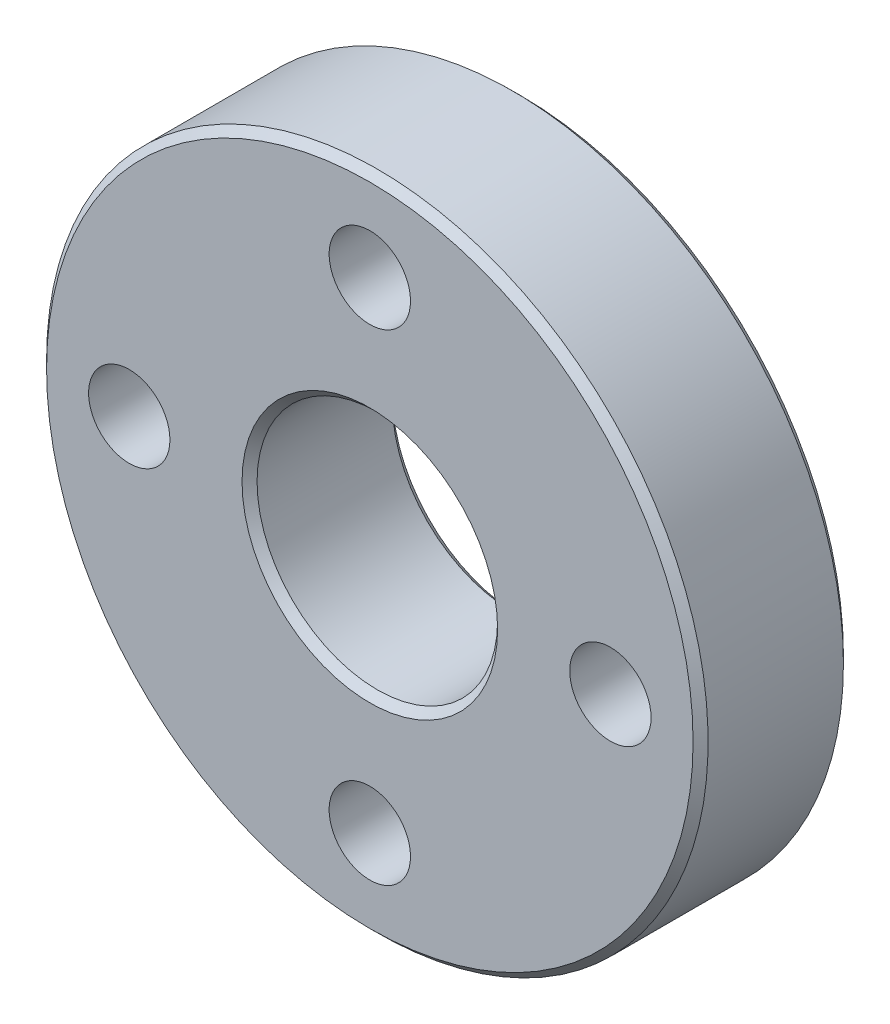
ISO-10303-21;
HEADER;
FILE_DESCRIPTION(('STEP AP214'),'2;1');
FILE_NAME('part.step','',(''),(''),'','','');
FILE_SCHEMA(('AUTOMOTIVE_DESIGN { 1 0 10303 214 1 1 1 1 }'));
ENDSEC;
DATA;
#1=APPLICATION_CONTEXT('core data for automotive mechanical design processes');
#2=APPLICATION_PROTOCOL_DEFINITION('international standard','automotive_design',2000,#1);
#3=PRODUCT_CONTEXT('',#1,'mechanical');
#4=PRODUCT('Part','Part','',(#3));
#5=PRODUCT_RELATED_PRODUCT_CATEGORY('part','',(#4));
#6=PRODUCT_DEFINITION_FORMATION('','',#4);
#7=PRODUCT_DEFINITION_CONTEXT('part definition',#1,'design');
#8=PRODUCT_DEFINITION('design','',#6,#7);
#9=PRODUCT_DEFINITION_SHAPE('','',#8);
#10=(LENGTH_UNIT() NAMED_UNIT(*) SI_UNIT(.MILLI.,.METRE.));
#11=(NAMED_UNIT(*) PLANE_ANGLE_UNIT() SI_UNIT($,.RADIAN.));
#12=(NAMED_UNIT(*) SI_UNIT($,.STERADIAN.) SOLID_ANGLE_UNIT());
#13=UNCERTAINTY_MEASURE_WITH_UNIT(LENGTH_MEASURE(1.E-05),#10,'distance_accuracy_value','');
#14=(GEOMETRIC_REPRESENTATION_CONTEXT(3) GLOBAL_UNCERTAINTY_ASSIGNED_CONTEXT((#13)) GLOBAL_UNIT_ASSIGNED_CONTEXT((#10,
#11,#12)) REPRESENTATION_CONTEXT('',''));
#15=CARTESIAN_POINT('',(0.,0.,0.));
#16=DIRECTION('',(0.,0.,1.));
#17=DIRECTION('',(1.,0.,0.));
#18=AXIS2_PLACEMENT_3D('',#15,#16,#17);
#19=CARTESIAN_POINT('',(0.,0.,-2.24999999994679));
#20=DIRECTION('',(0.,0.,1.));
#21=DIRECTION('',(1.,0.,0.));
#22=AXIS2_PLACEMENT_3D('',#19,#20,#21);
#23=CONICAL_SURFACE('',#22,11.0000000000241,0.785398163511135);
#24=CARTESIAN_POINT('',(0.,0.,-2.25));
#25=DIRECTION('',(0.,0.,-1.));
#26=DIRECTION('',(-1.,0.,0.));
#27=AXIS2_PLACEMENT_3D('',#24,#25,#26);
#28=CIRCLE('',#27,11.);
#29=CARTESIAN_POINT('',(-11.,0.,-2.25));
#30=VERTEX_POINT('',#29);
#31=EDGE_CURVE('E28',#30,#30,#28,.F.);
#32=ORIENTED_EDGE('',*,*,#31,.F.);
#33=EDGE_LOOP('',(#32));
#34=FACE_BOUND('',#33,.T.);
#35=CARTESIAN_POINT('',(0.,0.,-2.49999999999773));
#36=DIRECTION('',(0.,0.,1.));
#37=DIRECTION('',(1.,0.,0.));
#38=AXIS2_PLACEMENT_3D('',#35,#36,#37);
#39=CIRCLE('',#38,10.7499999999163);
#40=CARTESIAN_POINT('',(10.7499999999163,0.,-2.49999999999773));
#41=VERTEX_POINT('',#40);
#42=EDGE_CURVE('E16',#41,#41,#39,.T.);
#43=ORIENTED_EDGE('',*,*,#42,.T.);
#44=EDGE_LOOP('',(#43));
#45=FACE_BOUND('',#44,.T.);
#46=ADVANCED_FACE('F13',(#34,#45),#23,.T.);
#47=CARTESIAN_POINT('',(0.,0.,-2.49999999999773));
#48=DIRECTION('',(0.,0.,-1.));
#49=DIRECTION('',(-1.,0.,0.));
#50=AXIS2_PLACEMENT_3D('',#47,#48,#49);
#51=CONICAL_SURFACE('',#50,4.25000000001319,0.785398163511135);
#52=CARTESIAN_POINT('',(0.,0.,-2.49999999999773));
#53=DIRECTION('',(0.,0.,-1.));
#54=DIRECTION('',(-1.,0.,0.));
#55=AXIS2_PLACEMENT_3D('',#52,#53,#54);
#56=CIRCLE('',#55,4.25000000001319);
#57=CARTESIAN_POINT('',(-4.25000000001319,0.,-2.49999999999773));
#58=VERTEX_POINT('',#57);
#59=EDGE_CURVE('E54',#58,#58,#56,.T.);
#60=ORIENTED_EDGE('',*,*,#59,.T.);
#61=EDGE_LOOP('',(#60));
#62=FACE_BOUND('',#61,.T.);
#63=CARTESIAN_POINT('',(0.,0.,-2.25));
#64=DIRECTION('',(0.,0.,-1.));
#65=DIRECTION('',(-1.,0.,0.));
#66=AXIS2_PLACEMENT_3D('',#63,#64,#65);
#67=CIRCLE('',#66,4.);
#68=CARTESIAN_POINT('',(-4.,0.,-2.25));
#69=VERTEX_POINT('',#68);
#70=EDGE_CURVE('E62',#69,#69,#67,.F.);
#71=ORIENTED_EDGE('',*,*,#70,.T.);
#72=EDGE_LOOP('',(#71));
#73=FACE_BOUND('',#72,.T.);
#74=ADVANCED_FACE('F100',(#62,#73),#51,.F.);
#75=CARTESIAN_POINT('',(0.,0.,2.5));
#76=DIRECTION('',(0.,0.,-1.));
#77=DIRECTION('',(-1.,0.,0.));
#78=AXIS2_PLACEMENT_3D('',#75,#76,#77);
#79=CYLINDRICAL_SURFACE('',#78,11.);
#80=CARTESIAN_POINT('',(0.,0.,2.24999999994679));
#81=DIRECTION('',(0.,0.,-1.));
#82=DIRECTION('',(-1.,0.,0.));
#83=AXIS2_PLACEMENT_3D('',#80,#81,#82);
#84=CIRCLE('',#83,11.0000000000241);
#85=CARTESIAN_POINT('',(-11.0000000000241,0.,2.24999999994679));
#86=VERTEX_POINT('',#85);
#87=EDGE_CURVE('E56',#86,#86,#84,.F.);
#88=ORIENTED_EDGE('',*,*,#87,.F.);
#89=EDGE_LOOP('',(#88));
#90=FACE_BOUND('',#89,.T.);
#91=ORIENTED_EDGE('',*,*,#31,.T.);
#92=EDGE_LOOP('',(#91));
#93=FACE_BOUND('',#92,.T.);
#94=ADVANCED_FACE('F97',(#90,#93),#79,.T.);
#95=CARTESIAN_POINT('',(0.,0.,2.5));
#96=DIRECTION('',(0.,0.,-1.));
#97=DIRECTION('',(-1.,0.,0.));
#98=AXIS2_PLACEMENT_3D('',#95,#96,#97);
#99=CYLINDRICAL_SURFACE('',#98,4.);
#100=CARTESIAN_POINT('',(0.,0.,2.25000000000364));
#101=DIRECTION('',(0.,0.,1.));
#102=DIRECTION('',(1.,0.,0.));
#103=AXIS2_PLACEMENT_3D('',#100,#101,#102);
#104=CIRCLE('',#103,4.0000000000191);
#105=CARTESIAN_POINT('',(4.0000000000191,0.,2.25000000000364));
#106=VERTEX_POINT('',#105);
#107=EDGE_CURVE('E53',#106,#106,#104,.T.);
#108=ORIENTED_EDGE('',*,*,#107,.T.);
#109=EDGE_LOOP('',(#108));
#110=FACE_BOUND('',#109,.T.);
#111=ORIENTED_EDGE('',*,*,#70,.F.);
#112=EDGE_LOOP('',(#111));
#113=FACE_BOUND('',#112,.T.);
#114=ADVANCED_FACE('F73',(#110,#113),#99,.F.);
#115=CARTESIAN_POINT('',(0.,0.,-2.5));
#116=DIRECTION('',(0.,0.,1.));
#117=DIRECTION('',(1.,0.,0.));
#118=AXIS2_PLACEMENT_3D('',#115,#116,#117);
#119=PLANE('',#118);
#120=CARTESIAN_POINT('',(-8.,0.,-2.5));
#121=DIRECTION('',(0.,0.,1.));
#122=DIRECTION('',(1.,0.,0.));
#123=AXIS2_PLACEMENT_3D('',#120,#121,#122);
#124=CIRCLE('',#123,1.35254999999999);
#125=CARTESIAN_POINT('',(-6.64745000000001,0.,-2.5));
#126=VERTEX_POINT('',#125);
#127=EDGE_CURVE('E42',#126,#126,#124,.T.);
#128=ORIENTED_EDGE('',*,*,#127,.T.);
#129=EDGE_LOOP('',(#128));
#130=FACE_BOUND('',#129,.T.);
#131=CARTESIAN_POINT('',(0.,-8.,-2.5));
#132=DIRECTION('',(0.,0.,1.));
#133=DIRECTION('',(1.,0.,0.));
#134=AXIS2_PLACEMENT_3D('',#131,#132,#133);
#135=CIRCLE('',#134,1.35254999999999);
#136=CARTESIAN_POINT('',(1.35254999999999,-8.,-2.5));
#137=VERTEX_POINT('',#136);
#138=EDGE_CURVE('E45',#137,#137,#135,.T.);
#139=ORIENTED_EDGE('',*,*,#138,.T.);
#140=EDGE_LOOP('',(#139));
#141=FACE_BOUND('',#140,.T.);
#142=CARTESIAN_POINT('',(8.,0.,-2.5));
#143=DIRECTION('',(0.,0.,1.));
#144=DIRECTION('',(1.,0.,0.));
#145=AXIS2_PLACEMENT_3D('',#142,#143,#144);
#146=CIRCLE('',#145,1.35254999999999);
#147=CARTESIAN_POINT('',(9.35254999999999,0.,-2.5));
#148=VERTEX_POINT('',#147);
#149=EDGE_CURVE('E48',#148,#148,#146,.T.);
#150=ORIENTED_EDGE('',*,*,#149,.T.);
#151=EDGE_LOOP('',(#150));
#152=FACE_BOUND('',#151,.T.);
#153=CARTESIAN_POINT('',(0.,8.,-2.5));
#154=DIRECTION('',(0.,0.,1.));
#155=DIRECTION('',(1.,0.,0.));
#156=AXIS2_PLACEMENT_3D('',#153,#154,#155);
#157=CIRCLE('',#156,1.35254999999999);
#158=CARTESIAN_POINT('',(1.35254999999999,8.,-2.5));
#159=VERTEX_POINT('',#158);
#160=EDGE_CURVE('E51',#159,#159,#157,.T.);
#161=ORIENTED_EDGE('',*,*,#160,.T.);
#162=EDGE_LOOP('',(#161));
#163=FACE_BOUND('',#162,.T.);
#164=ORIENTED_EDGE('',*,*,#59,.F.);
#165=EDGE_LOOP('',(#164));
#166=FACE_BOUND('',#165,.T.);
#167=ORIENTED_EDGE('',*,*,#42,.F.);
#168=EDGE_LOOP('',(#167));
#169=FACE_BOUND('',#168,.T.);
#170=ADVANCED_FACE('F93',(#130,#141,#152,#163,#166,#169),#119,.F.);
#171=CARTESIAN_POINT('',(0.,0.,2.25000000000364));
#172=DIRECTION('',(0.,0.,-1.));
#173=DIRECTION('',(-1.,0.,0.));
#174=AXIS2_PLACEMENT_3D('',#171,#172,#173);
#175=CONICAL_SURFACE('',#174,10.9999999999673,0.785398163397448);
#176=CARTESIAN_POINT('',(0.,0.,2.49999999999773));
#177=DIRECTION('',(0.,0.,-1.));
#178=DIRECTION('',(-1.,0.,0.));
#179=AXIS2_PLACEMENT_3D('',#176,#177,#178);
#180=CIRCLE('',#179,10.7499999999732);
#181=CARTESIAN_POINT('',(-10.7499999999732,0.,2.49999999999773));
#182=VERTEX_POINT('',#181);
#183=EDGE_CURVE('E39',#182,#182,#180,.F.);
#184=ORIENTED_EDGE('',*,*,#183,.F.);
#185=EDGE_LOOP('',(#184));
#186=FACE_BOUND('',#185,.T.);
#187=ORIENTED_EDGE('',*,*,#87,.T.);
#188=EDGE_LOOP('',(#187));
#189=FACE_BOUND('',#188,.T.);
#190=ADVANCED_FACE('F80',(#186,#189),#175,.T.);
#191=CARTESIAN_POINT('',(0.,0.,2.50000000005457));
#192=DIRECTION('',(0.,0.,1.));
#193=DIRECTION('',(1.,0.,0.));
#194=AXIS2_PLACEMENT_3D('',#191,#192,#193);
#195=CONICAL_SURFACE('',#194,4.25000000001319,0.785398163283761);
#196=ORIENTED_EDGE('',*,*,#107,.F.);
#197=EDGE_LOOP('',(#196));
#198=FACE_BOUND('',#197,.T.);
#199=CARTESIAN_POINT('',(0.,0.,2.50000000005457));
#200=DIRECTION('',(0.,0.,1.));
#201=DIRECTION('',(1.,0.,0.));
#202=AXIS2_PLACEMENT_3D('',#199,#200,#201);
#203=CIRCLE('',#202,4.25000000001319);
#204=CARTESIAN_POINT('',(4.25000000001319,0.,2.50000000005457));
#205=VERTEX_POINT('',#204);
#206=EDGE_CURVE('E36',#205,#205,#203,.F.);
#207=ORIENTED_EDGE('',*,*,#206,.F.);
#208=EDGE_LOOP('',(#207));
#209=FACE_BOUND('',#208,.T.);
#210=ADVANCED_FACE('F76',(#198,#209),#195,.F.);
#211=CARTESIAN_POINT('',(0.,8.,2.5));
#212=DIRECTION('',(0.,0.,1.));
#213=DIRECTION('',(1.,0.,0.));
#214=AXIS2_PLACEMENT_3D('',#211,#212,#213);
#215=CYLINDRICAL_SURFACE('',#214,1.35254999999999);
#216=CARTESIAN_POINT('',(0.,8.,2.5));
#217=DIRECTION('',(0.,0.,1.));
#218=DIRECTION('',(1.,0.,0.));
#219=AXIS2_PLACEMENT_3D('',#216,#217,#218);
#220=CIRCLE('',#219,1.35254999999999);
#221=CARTESIAN_POINT('',(1.35254999999999,8.,2.5));
#222=VERTEX_POINT('',#221);
#223=EDGE_CURVE('E33',#222,#222,#220,.F.);
#224=ORIENTED_EDGE('',*,*,#223,.F.);
#225=EDGE_LOOP('',(#224));
#226=FACE_BOUND('',#225,.T.);
#227=ORIENTED_EDGE('',*,*,#160,.F.);
#228=EDGE_LOOP('',(#227));
#229=FACE_BOUND('',#228,.T.);
#230=ADVANCED_FACE('F79',(#226,#229),#215,.F.);
#231=CARTESIAN_POINT('',(8.,0.,2.5));
#232=DIRECTION('',(0.,0.,1.));
#233=DIRECTION('',(1.,0.,0.));
#234=AXIS2_PLACEMENT_3D('',#231,#232,#233);
#235=CYLINDRICAL_SURFACE('',#234,1.35254999999999);
#236=CARTESIAN_POINT('',(8.,0.,2.5));
#237=DIRECTION('',(0.,0.,1.));
#238=DIRECTION('',(1.,0.,0.));
#239=AXIS2_PLACEMENT_3D('',#236,#237,#238);
#240=CIRCLE('',#239,1.35254999999999);
#241=CARTESIAN_POINT('',(9.35254999999999,0.,2.5));
#242=VERTEX_POINT('',#241);
#243=EDGE_CURVE('E25',#242,#242,#240,.F.);
#244=ORIENTED_EDGE('',*,*,#243,.F.);
#245=EDGE_LOOP('',(#244));
#246=FACE_BOUND('',#245,.T.);
#247=ORIENTED_EDGE('',*,*,#149,.F.);
#248=EDGE_LOOP('',(#247));
#249=FACE_BOUND('',#248,.T.);
#250=ADVANCED_FACE('F119',(#246,#249),#235,.F.);
#251=CARTESIAN_POINT('',(0.,-8.,2.5));
#252=DIRECTION('',(0.,0.,1.));
#253=DIRECTION('',(1.,0.,0.));
#254=AXIS2_PLACEMENT_3D('',#251,#252,#253);
#255=CYLINDRICAL_SURFACE('',#254,1.35254999999999);
#256=CARTESIAN_POINT('',(0.,-8.,2.5));
#257=DIRECTION('',(0.,0.,1.));
#258=DIRECTION('',(1.,0.,0.));
#259=AXIS2_PLACEMENT_3D('',#256,#257,#258);
#260=CIRCLE('',#259,1.35254999999999);
#261=CARTESIAN_POINT('',(1.35254999999999,-8.,2.5));
#262=VERTEX_POINT('',#261);
#263=EDGE_CURVE('E20',#262,#262,#260,.F.);
#264=ORIENTED_EDGE('',*,*,#263,.F.);
#265=EDGE_LOOP('',(#264));
#266=FACE_BOUND('',#265,.T.);
#267=ORIENTED_EDGE('',*,*,#138,.F.);
#268=EDGE_LOOP('',(#267));
#269=FACE_BOUND('',#268,.T.);
#270=ADVANCED_FACE('F123',(#266,#269),#255,.F.);
#271=CARTESIAN_POINT('',(-8.,0.,2.5));
#272=DIRECTION('',(0.,0.,1.));
#273=DIRECTION('',(1.,0.,0.));
#274=AXIS2_PLACEMENT_3D('',#271,#272,#273);
#275=CYLINDRICAL_SURFACE('',#274,1.35254999999999);
#276=CARTESIAN_POINT('',(-8.,0.,2.5));
#277=DIRECTION('',(0.,0.,1.));
#278=DIRECTION('',(1.,0.,0.));
#279=AXIS2_PLACEMENT_3D('',#276,#277,#278);
#280=CIRCLE('',#279,1.35254999999999);
#281=CARTESIAN_POINT('',(-6.64745000000001,0.,2.5));
#282=VERTEX_POINT('',#281);
#283=EDGE_CURVE('E9',#282,#282,#280,.F.);
#284=ORIENTED_EDGE('',*,*,#283,.F.);
#285=EDGE_LOOP('',(#284));
#286=FACE_BOUND('',#285,.T.);
#287=ORIENTED_EDGE('',*,*,#127,.F.);
#288=EDGE_LOOP('',(#287));
#289=FACE_BOUND('',#288,.T.);
#290=ADVANCED_FACE('F87',(#286,#289),#275,.F.);
#291=CARTESIAN_POINT('',(0.,0.,2.5));
#292=DIRECTION('',(0.,0.,1.));
#293=DIRECTION('',(1.,0.,0.));
#294=AXIS2_PLACEMENT_3D('',#291,#292,#293);
#295=PLANE('',#294);
#296=ORIENTED_EDGE('',*,*,#283,.T.);
#297=EDGE_LOOP('',(#296));
#298=FACE_BOUND('',#297,.T.);
#299=ORIENTED_EDGE('',*,*,#263,.T.);
#300=EDGE_LOOP('',(#299));
#301=FACE_BOUND('',#300,.T.);
#302=ORIENTED_EDGE('',*,*,#243,.T.);
#303=EDGE_LOOP('',(#302));
#304=FACE_BOUND('',#303,.T.);
#305=ORIENTED_EDGE('',*,*,#223,.T.);
#306=EDGE_LOOP('',(#305));
#307=FACE_BOUND('',#306,.T.);
#308=ORIENTED_EDGE('',*,*,#206,.T.);
#309=EDGE_LOOP('',(#308));
#310=FACE_BOUND('',#309,.T.);
#311=ORIENTED_EDGE('',*,*,#183,.T.);
#312=EDGE_LOOP('',(#311));
#313=FACE_BOUND('',#312,.T.);
#314=ADVANCED_FACE('F84',(#298,#301,#304,#307,#310,#313),#295,.T.);
#315=CLOSED_SHELL('',(#46,#74,#94,#114,#170,#190,#210,#230,#250,#270,#290,#314));
#316=MANIFOLD_SOLID_BREP('B1',#315);
#317=ADVANCED_BREP_SHAPE_REPRESENTATION('',(#18,#316),#14);
#318=SHAPE_DEFINITION_REPRESENTATION(#9,#317);
ENDSEC;
END-ISO-10303-21;
